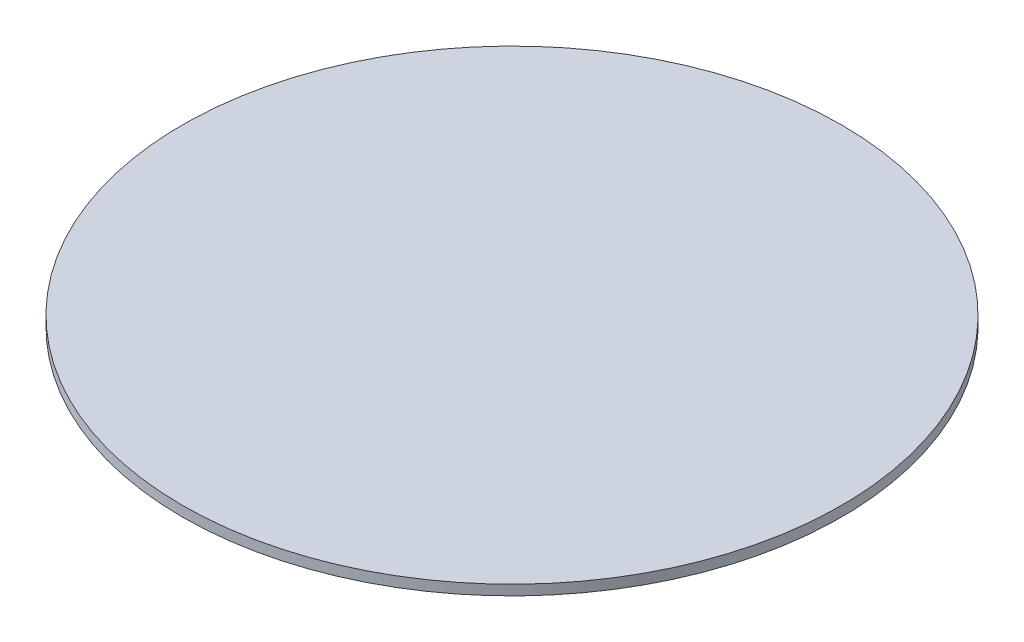
ISO-10303-21;
HEADER;
FILE_DESCRIPTION(('STEP AP214'),'2;1');
FILE_NAME('part.step','',(''),(''),'','','');
FILE_SCHEMA(('AUTOMOTIVE_DESIGN { 1 0 10303 214 1 1 1 1 }'));
ENDSEC;
DATA;
#1=APPLICATION_CONTEXT('core data for automotive mechanical design processes');
#2=APPLICATION_PROTOCOL_DEFINITION('international standard','automotive_design',2000,#1);
#3=PRODUCT_CONTEXT('',#1,'mechanical');
#4=PRODUCT('Part','Part','',(#3));
#5=PRODUCT_RELATED_PRODUCT_CATEGORY('part','',(#4));
#6=PRODUCT_DEFINITION_FORMATION('','',#4);
#7=PRODUCT_DEFINITION_CONTEXT('part definition',#1,'design');
#8=PRODUCT_DEFINITION('design','',#6,#7);
#9=PRODUCT_DEFINITION_SHAPE('','',#8);
#10=(LENGTH_UNIT() NAMED_UNIT(*) SI_UNIT(.MILLI.,.METRE.));
#11=(NAMED_UNIT(*) PLANE_ANGLE_UNIT() SI_UNIT($,.RADIAN.));
#12=(NAMED_UNIT(*) SI_UNIT($,.STERADIAN.) SOLID_ANGLE_UNIT());
#13=UNCERTAINTY_MEASURE_WITH_UNIT(LENGTH_MEASURE(1.E-05),#10,'distance_accuracy_value','');
#14=(GEOMETRIC_REPRESENTATION_CONTEXT(3) GLOBAL_UNCERTAINTY_ASSIGNED_CONTEXT((#13)) GLOBAL_UNIT_ASSIGNED_CONTEXT((#10,
#11,#12)) REPRESENTATION_CONTEXT('',''));
#15=CARTESIAN_POINT('',(0.,0.,0.));
#16=DIRECTION('',(0.,0.,1.));
#17=DIRECTION('',(1.,0.,0.));
#18=AXIS2_PLACEMENT_3D('',#15,#16,#17);
#19=CARTESIAN_POINT('',(0.,0.127,0.));
#20=DIRECTION('',(0.,1.,0.));
#21=DIRECTION('',(0.,0.,1.));
#22=AXIS2_PLACEMENT_3D('',#19,#20,#21);
#23=PLANE('',#22);
#24=CARTESIAN_POINT('',(0.,0.127,0.));
#25=DIRECTION('',(0.,1.,0.));
#26=DIRECTION('',(0.,0.,1.));
#27=AXIS2_PLACEMENT_3D('',#24,#25,#26);
#28=CIRCLE('',#27,4.1275);
#29=CARTESIAN_POINT('',(0.,0.127,4.1275));
#30=VERTEX_POINT('',#29);
#31=EDGE_CURVE('E17',#30,#30,#28,.F.);
#32=ORIENTED_EDGE('',*,*,#31,.F.);
#33=EDGE_LOOP('',(#32));
#34=FACE_BOUND('',#33,.T.);
#35=ADVANCED_FACE('F14',(#34),#23,.T.);
#36=CARTESIAN_POINT('',(0.,0.127,0.));
#37=DIRECTION('',(0.,1.,0.));
#38=DIRECTION('',(0.,0.,1.));
#39=AXIS2_PLACEMENT_3D('',#36,#37,#38);
#40=CYLINDRICAL_SURFACE('',#39,4.1275);
#41=CARTESIAN_POINT('',(0.,0.,0.));
#42=DIRECTION('',(0.,1.,0.));
#43=DIRECTION('',(0.,0.,1.));
#44=AXIS2_PLACEMENT_3D('',#41,#42,#43);
#45=CIRCLE('',#44,4.1275);
#46=CARTESIAN_POINT('',(0.,0.,4.1275));
#47=VERTEX_POINT('',#46);
#48=EDGE_CURVE('E10',#47,#47,#45,.T.);
#49=ORIENTED_EDGE('',*,*,#48,.T.);
#50=EDGE_LOOP('',(#49));
#51=FACE_BOUND('',#50,.T.);
#52=ORIENTED_EDGE('',*,*,#31,.T.);
#53=EDGE_LOOP('',(#52));
#54=FACE_BOUND('',#53,.T.);
#55=ADVANCED_FACE('F26',(#51,#54),#40,.T.);
#56=CARTESIAN_POINT('',(0.,0.,0.));
#57=DIRECTION('',(0.,1.,0.));
#58=DIRECTION('',(0.,0.,1.));
#59=AXIS2_PLACEMENT_3D('',#56,#57,#58);
#60=PLANE('',#59);
#61=ORIENTED_EDGE('',*,*,#48,.F.);
#62=EDGE_LOOP('',(#61));
#63=FACE_BOUND('',#62,.T.);
#64=ADVANCED_FACE('F33',(#63),#60,.F.);
#65=CLOSED_SHELL('',(#35,#55,#64));
#66=MANIFOLD_SOLID_BREP('B1',#65);
#67=ADVANCED_BREP_SHAPE_REPRESENTATION('',(#18,#66),#14);
#68=SHAPE_DEFINITION_REPRESENTATION(#9,#67);
ENDSEC;
END-ISO-10303-21;
